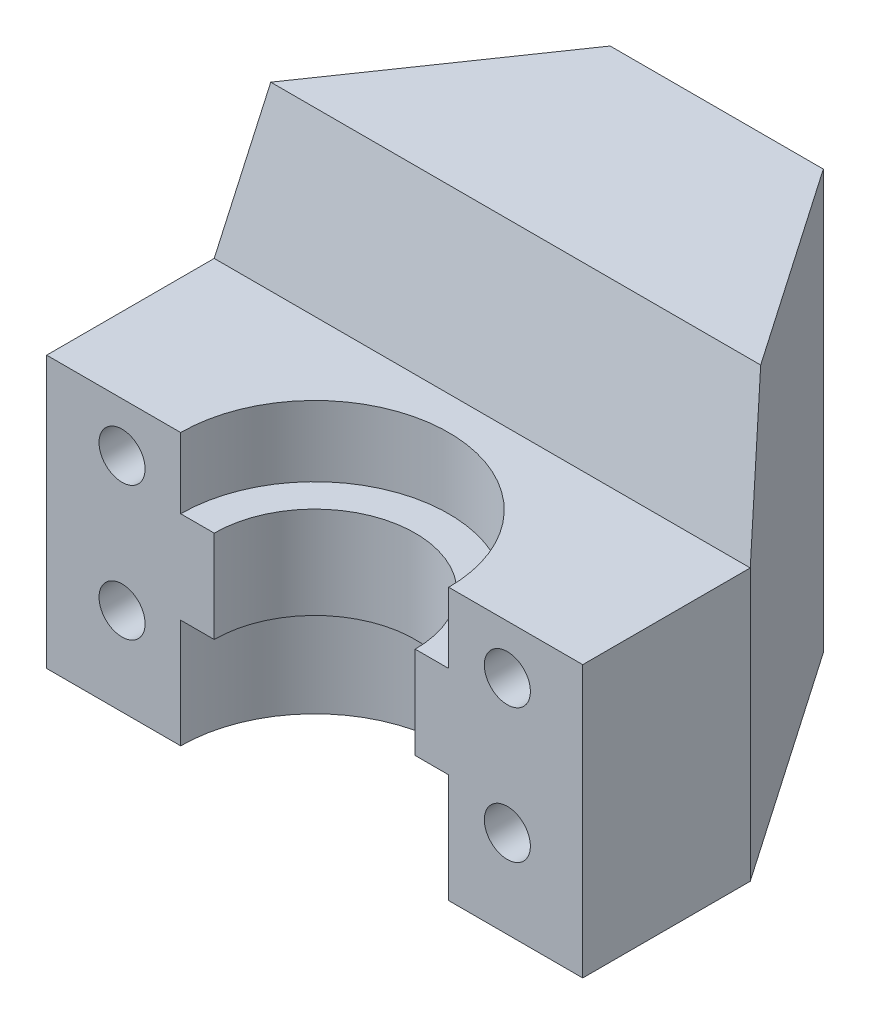
ISO-10303-21;
HEADER;
FILE_DESCRIPTION(('STEP AP214'),'2;1');
FILE_NAME('part.step','',(''),(''),'','','');
FILE_SCHEMA(('AUTOMOTIVE_DESIGN { 1 0 10303 214 1 1 1 1 }'));
ENDSEC;
DATA;
#1=APPLICATION_CONTEXT('core data for automotive mechanical design processes');
#2=APPLICATION_PROTOCOL_DEFINITION('international standard','automotive_design',2000,#1);
#3=PRODUCT_CONTEXT('',#1,'mechanical');
#4=PRODUCT('Part','Part','',(#3));
#5=PRODUCT_RELATED_PRODUCT_CATEGORY('part','',(#4));
#6=PRODUCT_DEFINITION_FORMATION('','',#4);
#7=PRODUCT_DEFINITION_CONTEXT('part definition',#1,'design');
#8=PRODUCT_DEFINITION('design','',#6,#7);
#9=PRODUCT_DEFINITION_SHAPE('','',#8);
#10=(LENGTH_UNIT() NAMED_UNIT(*) SI_UNIT(.MILLI.,.METRE.));
#11=(NAMED_UNIT(*) PLANE_ANGLE_UNIT() SI_UNIT($,.RADIAN.));
#12=(NAMED_UNIT(*) SI_UNIT($,.STERADIAN.) SOLID_ANGLE_UNIT());
#13=UNCERTAINTY_MEASURE_WITH_UNIT(LENGTH_MEASURE(1.E-05),#10,'distance_accuracy_value','');
#14=(GEOMETRIC_REPRESENTATION_CONTEXT(3) GLOBAL_UNCERTAINTY_ASSIGNED_CONTEXT((#13)) GLOBAL_UNIT_ASSIGNED_CONTEXT((#10,
#11,#12)) REPRESENTATION_CONTEXT('',''));
#15=CARTESIAN_POINT('',(0.,0.,0.));
#16=DIRECTION('',(0.,0.,1.));
#17=DIRECTION('',(1.,0.,0.));
#18=AXIS2_PLACEMENT_3D('',#15,#16,#17);
#19=CARTESIAN_POINT('',(-16.,16.2,12.));
#20=DIRECTION('',(0.,0.,-1.));
#21=DIRECTION('',(-1.,0.,0.));
#22=AXIS2_PLACEMENT_3D('',#19,#20,#21);
#23=PLANE('',#22);
#24=CARTESIAN_POINT('',(11.5,13.25,12.));
#25=DIRECTION('',(0.,0.,1.));
#26=DIRECTION('',(1.,0.,0.));
#27=AXIS2_PLACEMENT_3D('',#24,#25,#26);
#28=CIRCLE('',#27,1.375);
#29=CARTESIAN_POINT('',(12.875,13.25,12.));
#30=VERTEX_POINT('',#29);
#31=EDGE_CURVE('E161',#30,#30,#28,.T.);
#32=ORIENTED_EDGE('',*,*,#31,.F.);
#33=EDGE_LOOP('',(#32));
#34=FACE_BOUND('',#33,.T.);
#35=CARTESIAN_POINT('',(11.5,5.25,12.));
#36=DIRECTION('',(0.,0.,1.));
#37=DIRECTION('',(1.,0.,0.));
#38=AXIS2_PLACEMENT_3D('',#35,#36,#37);
#39=CIRCLE('',#38,1.375);
#40=CARTESIAN_POINT('',(12.875,5.25,12.));
#41=VERTEX_POINT('',#40);
#42=EDGE_CURVE('E178',#41,#41,#39,.T.);
#43=ORIENTED_EDGE('',*,*,#42,.F.);
#44=EDGE_LOOP('',(#43));
#45=FACE_BOUND('',#44,.T.);
#46=DIRECTION('',(1.,0.,0.));
#47=VECTOR('',#46,1.);
#48=CARTESIAN_POINT('',(-16.,16.2,12.));
#49=LINE('',#48,#47);
#50=CARTESIAN_POINT('',(8.,16.2,12.));
#51=VERTEX_POINT('',#50);
#52=CARTESIAN_POINT('',(16.,16.2,12.));
#53=VERTEX_POINT('',#52);
#54=EDGE_CURVE('E239',#51,#53,#49,.T.);
#55=ORIENTED_EDGE('',*,*,#54,.F.);
#56=DIRECTION('',(0.,-1.,0.));
#57=VECTOR('',#56,1.);
#58=CARTESIAN_POINT('',(8.,0.,12.));
#59=LINE('',#58,#57);
#60=CARTESIAN_POINT('',(8.,12.,12.));
#61=VERTEX_POINT('',#60);
#62=EDGE_CURVE('E62',#51,#61,#59,.T.);
#63=ORIENTED_EDGE('',*,*,#62,.T.);
#64=DIRECTION('',(-1.,0.,0.));
#65=VECTOR('',#64,1.);
#66=CARTESIAN_POINT('',(-16.,12.,12.));
#67=LINE('',#66,#65);
#68=CARTESIAN_POINT('',(6.,12.,12.));
#69=VERTEX_POINT('',#68);
#70=EDGE_CURVE('E11',#61,#69,#67,.T.);
#71=ORIENTED_EDGE('',*,*,#70,.T.);
#72=DIRECTION('',(0.,-1.,0.));
#73=VECTOR('',#72,1.);
#74=CARTESIAN_POINT('',(6.,0.,12.));
#75=LINE('',#74,#73);
#76=CARTESIAN_POINT('',(6.,6.5,12.));
#77=VERTEX_POINT('',#76);
#78=EDGE_CURVE('E41',#69,#77,#75,.T.);
#79=ORIENTED_EDGE('',*,*,#78,.T.);
#80=DIRECTION('',(1.,0.,0.));
#81=VECTOR('',#80,1.);
#82=CARTESIAN_POINT('',(-16.,6.5,12.));
#83=LINE('',#82,#81);
#84=CARTESIAN_POINT('',(8.,6.5,12.));
#85=VERTEX_POINT('',#84);
#86=EDGE_CURVE('E282',#77,#85,#83,.T.);
#87=ORIENTED_EDGE('',*,*,#86,.T.);
#88=DIRECTION('',(0.,-1.,0.));
#89=VECTOR('',#88,1.);
#90=CARTESIAN_POINT('',(8.,0.,12.));
#91=LINE('',#90,#89);
#92=CARTESIAN_POINT('',(8.,0.,12.));
#93=VERTEX_POINT('',#92);
#94=EDGE_CURVE('E285',#85,#93,#91,.T.);
#95=ORIENTED_EDGE('',*,*,#94,.T.);
#96=DIRECTION('',(1.,0.,0.));
#97=VECTOR('',#96,1.);
#98=CARTESIAN_POINT('',(-16.,0.,12.));
#99=LINE('',#98,#97);
#100=CARTESIAN_POINT('',(16.,0.,12.));
#101=VERTEX_POINT('',#100);
#102=EDGE_CURVE('E235',#93,#101,#99,.T.);
#103=ORIENTED_EDGE('',*,*,#102,.T.);
#104=DIRECTION('',(0.,-1.,0.));
#105=VECTOR('',#104,1.);
#106=CARTESIAN_POINT('',(16.,16.2,12.));
#107=LINE('',#106,#105);
#108=EDGE_CURVE('E247',#53,#101,#107,.T.);
#109=ORIENTED_EDGE('',*,*,#108,.F.);
#110=EDGE_LOOP('',(#55,#63,#71,#79,#87,#95,#103,#109));
#111=FACE_BOUND('',#110,.T.);
#112=ADVANCED_FACE('F37',(#34,#45,#111),#23,.F.);
#113=CARTESIAN_POINT('',(16.,0.,0.));
#114=DIRECTION('',(0.,1.,0.));
#115=DIRECTION('',(0.,0.,1.));
#116=AXIS2_PLACEMENT_3D('',#113,#114,#115);
#117=PLANE('',#116);
#118=DIRECTION('',(0.,0.,-1.));
#119=VECTOR('',#118,1.);
#120=CARTESIAN_POINT('',(-16.,0.,0.));
#121=LINE('',#120,#119);
#122=CARTESIAN_POINT('',(-16.,0.,12.));
#123=VERTEX_POINT('',#122);
#124=CARTESIAN_POINT('',(-16.,0.,2.));
#125=VERTEX_POINT('',#124);
#126=EDGE_CURVE('E258',#123,#125,#121,.T.);
#127=ORIENTED_EDGE('',*,*,#126,.T.);
#128=DIRECTION('',(-0.567028119188884,0.,0.823698435138198));
#129=VECTOR('',#128,1.);
#130=CARTESIAN_POINT('',(-9.92154544387538,0.,-6.82992101538207));
#131=LINE('',#130,#129);
#132=CARTESIAN_POINT('',(-6.3625,0.,-12.));
#133=VERTEX_POINT('',#132);
#134=EDGE_CURVE('E193',#133,#125,#131,.T.);
#135=ORIENTED_EDGE('',*,*,#134,.F.);
#136=DIRECTION('',(-1.,0.,0.));
#137=VECTOR('',#136,1.);
#138=CARTESIAN_POINT('',(16.,0.,-12.));
#139=LINE('',#138,#137);
#140=CARTESIAN_POINT('',(6.3625,0.,-12.));
#141=VERTEX_POINT('',#140);
#142=EDGE_CURVE('E270',#141,#133,#139,.T.);
#143=ORIENTED_EDGE('',*,*,#142,.F.);
#144=DIRECTION('',(-0.567028119188885,0.,-0.823698435138198));
#145=VECTOR('',#144,1.);
#146=CARTESIAN_POINT('',(9.92154544387538,0.,-6.82992101538207));
#147=LINE('',#146,#145);
#148=CARTESIAN_POINT('',(16.,0.,2.));
#149=VERTEX_POINT('',#148);
#150=EDGE_CURVE('E203',#149,#141,#147,.T.);
#151=ORIENTED_EDGE('',*,*,#150,.F.);
#152=DIRECTION('',(0.,0.,-1.));
#153=VECTOR('',#152,1.);
#154=CARTESIAN_POINT('',(16.,0.,0.));
#155=LINE('',#154,#153);
#156=EDGE_CURVE('E259',#101,#149,#155,.T.);
#157=ORIENTED_EDGE('',*,*,#156,.F.);
#158=ORIENTED_EDGE('',*,*,#102,.F.);
#159=CARTESIAN_POINT('',(0.,0.,12.));
#160=DIRECTION('',(0.,-1.,0.));
#161=DIRECTION('',(0.,0.,-1.));
#162=AXIS2_PLACEMENT_3D('',#159,#160,#161);
#163=CIRCLE('',#162,8.);
#164=CARTESIAN_POINT('',(-8.,0.,12.));
#165=VERTEX_POINT('',#164);
#166=EDGE_CURVE('E206',#165,#93,#163,.T.);
#167=ORIENTED_EDGE('',*,*,#166,.F.);
#168=EDGE_CURVE('E240',#123,#165,#99,.T.);
#169=ORIENTED_EDGE('',*,*,#168,.F.);
#170=EDGE_LOOP('',(#127,#135,#143,#151,#157,#158,#167,#169));
#171=FACE_BOUND('',#170,.T.);
#172=ADVANCED_FACE('F39',(#171),#117,.F.);
#173=CARTESIAN_POINT('',(16.,0.,-12.));
#174=DIRECTION('',(0.,0.,1.));
#175=DIRECTION('',(1.,0.,0.));
#176=AXIS2_PLACEMENT_3D('',#173,#174,#175);
#177=PLANE('',#176);
#178=CARTESIAN_POINT('',(0.,20.,-12.));
#179=DIRECTION('',(0.,0.,-1.));
#180=DIRECTION('',(-1.,0.,0.));
#181=AXIS2_PLACEMENT_3D('',#178,#179,#180);
#182=CIRCLE('',#181,2.09999999999999);
#183=CARTESIAN_POINT('',(-2.09999999999999,20.,-12.));
#184=VERTEX_POINT('',#183);
#185=EDGE_CURVE('E223',#184,#184,#182,.T.);
#186=ORIENTED_EDGE('',*,*,#185,.F.);
#187=EDGE_LOOP('',(#186));
#188=FACE_BOUND('',#187,.T.);
#189=CARTESIAN_POINT('',(0.,5.,-12.));
#190=DIRECTION('',(0.,0.,-1.));
#191=DIRECTION('',(-1.,0.,0.));
#192=AXIS2_PLACEMENT_3D('',#189,#190,#191);
#193=CIRCLE('',#192,2.09999999999999);
#194=CARTESIAN_POINT('',(-2.09999999999999,5.,-12.));
#195=VERTEX_POINT('',#194);
#196=EDGE_CURVE('E229',#195,#195,#193,.T.);
#197=ORIENTED_EDGE('',*,*,#196,.F.);
#198=EDGE_LOOP('',(#197));
#199=FACE_BOUND('',#198,.T.);
#200=ORIENTED_EDGE('',*,*,#142,.T.);
#201=DIRECTION('',(0.,1.,0.));
#202=VECTOR('',#201,1.);
#203=CARTESIAN_POINT('',(-6.3625,-0.001000000000001,-12.));
#204=LINE('',#203,#202);
#205=CARTESIAN_POINT('',(-6.3625,25.,-12.));
#206=VERTEX_POINT('',#205);
#207=EDGE_CURVE('E190',#133,#206,#204,.T.);
#208=ORIENTED_EDGE('',*,*,#207,.T.);
#209=DIRECTION('',(-1.,0.,0.));
#210=VECTOR('',#209,1.);
#211=CARTESIAN_POINT('',(16.,25.,-12.));
#212=LINE('',#211,#210);
#213=CARTESIAN_POINT('',(6.3625,25.,-12.));
#214=VERTEX_POINT('',#213);
#215=EDGE_CURVE('E267',#214,#206,#212,.T.);
#216=ORIENTED_EDGE('',*,*,#215,.F.);
#217=DIRECTION('',(0.,1.,0.));
#218=VECTOR('',#217,1.);
#219=CARTESIAN_POINT('',(6.3625,-0.001000000000001,-12.));
#220=LINE('',#219,#218);
#221=EDGE_CURVE('E199',#141,#214,#220,.T.);
#222=ORIENTED_EDGE('',*,*,#221,.F.);
#223=EDGE_LOOP('',(#200,#208,#216,#222));
#224=FACE_BOUND('',#223,.T.);
#225=ADVANCED_FACE('F333',(#188,#199,#224),#177,.F.);
#226=CARTESIAN_POINT('',(16.,25.,0.));
#227=DIRECTION('',(0.,1.,0.));
#228=DIRECTION('',(0.,0.,1.));
#229=AXIS2_PLACEMENT_3D('',#226,#227,#228);
#230=PLANE('',#229);
#231=DIRECTION('',(0.567028119188884,0.,-0.823698435138198));
#232=VECTOR('',#231,1.);
#233=CARTESIAN_POINT('',(-9.92154544387538,25.,-6.82992101538207));
#234=LINE('',#233,#232);
#235=CARTESIAN_POINT('',(-14.6232142857143,25.,0.));
#236=VERTEX_POINT('',#235);
#237=EDGE_CURVE('E187',#236,#206,#234,.T.);
#238=ORIENTED_EDGE('',*,*,#237,.F.);
#239=DIRECTION('',(-1.,0.,0.));
#240=VECTOR('',#239,1.);
#241=CARTESIAN_POINT('',(16.,25.,0.));
#242=LINE('',#241,#240);
#243=CARTESIAN_POINT('',(14.6232142857143,25.,0.));
#244=VERTEX_POINT('',#243);
#245=EDGE_CURVE('E262',#244,#236,#242,.T.);
#246=ORIENTED_EDGE('',*,*,#245,.F.);
#247=DIRECTION('',(0.567028119188885,0.,0.823698435138198));
#248=VECTOR('',#247,1.);
#249=CARTESIAN_POINT('',(9.92154544387538,25.,-6.82992101538207));
#250=LINE('',#249,#248);
#251=EDGE_CURVE('E54',#214,#244,#250,.T.);
#252=ORIENTED_EDGE('',*,*,#251,.F.);
#253=ORIENTED_EDGE('',*,*,#215,.T.);
#254=EDGE_LOOP('',(#238,#246,#252,#253));
#255=FACE_BOUND('',#254,.T.);
#256=ADVANCED_FACE('F329',(#255),#230,.T.);
#257=CARTESIAN_POINT('',(16.,0.,0.));
#258=DIRECTION('',(1.,0.,0.));
#259=DIRECTION('',(0.,0.,-1.));
#260=AXIS2_PLACEMENT_3D('',#257,#258,#259);
#261=PLANE('',#260);
#262=DIRECTION('',(0.,1.,0.));
#263=VECTOR('',#262,1.);
#264=CARTESIAN_POINT('',(16.,-0.001000000000001,2.));
#265=LINE('',#264,#263);
#266=CARTESIAN_POINT('',(16.,16.2,2.));
#267=VERTEX_POINT('',#266);
#268=EDGE_CURVE('E200',#149,#267,#265,.T.);
#269=ORIENTED_EDGE('',*,*,#268,.T.);
#270=DIRECTION('',(0.,0.,-1.));
#271=VECTOR('',#270,1.);
#272=CARTESIAN_POINT('',(16.,16.2,12.));
#273=LINE('',#272,#271);
#274=EDGE_CURVE('E244',#53,#267,#273,.T.);
#275=ORIENTED_EDGE('',*,*,#274,.F.);
#276=ORIENTED_EDGE('',*,*,#108,.T.);
#277=ORIENTED_EDGE('',*,*,#156,.T.);
#278=EDGE_LOOP('',(#269,#275,#276,#277));
#279=FACE_BOUND('',#278,.T.);
#280=ADVANCED_FACE('F316',(#279),#261,.T.);
#281=CARTESIAN_POINT('',(-16.,0.,0.));
#282=DIRECTION('',(1.,0.,0.));
#283=DIRECTION('',(0.,0.,-1.));
#284=AXIS2_PLACEMENT_3D('',#281,#282,#283);
#285=PLANE('',#284);
#286=DIRECTION('',(0.,0.,1.));
#287=VECTOR('',#286,1.);
#288=CARTESIAN_POINT('',(-16.,16.2,12.));
#289=LINE('',#288,#287);
#290=CARTESIAN_POINT('',(-16.,16.2,2.));
#291=VERTEX_POINT('',#290);
#292=CARTESIAN_POINT('',(-16.,16.2,12.));
#293=VERTEX_POINT('',#292);
#294=EDGE_CURVE('E236',#291,#293,#289,.T.);
#295=ORIENTED_EDGE('',*,*,#294,.F.);
#296=DIRECTION('',(0.,1.,0.));
#297=VECTOR('',#296,1.);
#298=CARTESIAN_POINT('',(-16.,-0.001000000000001,2.00000000000001));
#299=LINE('',#298,#297);
#300=EDGE_CURVE('E189',#125,#291,#299,.T.);
#301=ORIENTED_EDGE('',*,*,#300,.F.);
#302=ORIENTED_EDGE('',*,*,#126,.F.);
#303=DIRECTION('',(0.,-1.,0.));
#304=VECTOR('',#303,1.);
#305=CARTESIAN_POINT('',(-16.,16.2,12.));
#306=LINE('',#305,#304);
#307=EDGE_CURVE('E252',#293,#123,#306,.T.);
#308=ORIENTED_EDGE('',*,*,#307,.F.);
#309=EDGE_LOOP('',(#295,#301,#302,#308));
#310=FACE_BOUND('',#309,.T.);
#311=ADVANCED_FACE('F364',(#310),#285,.F.);
#312=CARTESIAN_POINT('',(-41.0798724079689,25.,0.));
#313=DIRECTION('',(0.,0.221621103588968,0.97513285579146));
#314=DIRECTION('',(0.,-0.97513285579146,0.221621103588968));
#315=AXIS2_PLACEMENT_3D('',#312,#313,#314);
#316=PLANE('',#315);
#317=DIRECTION('',(-0.150817322697507,-0.963978944556828,0.219086123762915));
#318=VECTOR('',#317,1.);
#319=CARTESIAN_POINT('',(-17.9253601038493,3.89367757228364,4.79689146084463));
#320=LINE('',#319,#318);
#321=EDGE_CURVE('E184',#236,#291,#320,.T.);
#322=ORIENTED_EDGE('',*,*,#321,.T.);
#323=DIRECTION('',(1.,0.,0.));
#324=VECTOR('',#323,1.);
#325=CARTESIAN_POINT('',(-41.0798724079689,16.2,2.00000000000001));
#326=LINE('',#325,#324);
#327=EDGE_CURVE('E255',#291,#267,#326,.T.);
#328=ORIENTED_EDGE('',*,*,#327,.T.);
#329=DIRECTION('',(-0.150817322697507,0.963978944556828,-0.219086123762915));
#330=VECTOR('',#329,1.);
#331=CARTESIAN_POINT('',(17.9253601038493,3.89367757228364,4.79689146084463));
#332=LINE('',#331,#330);
#333=EDGE_CURVE('E196',#267,#244,#332,.T.);
#334=ORIENTED_EDGE('',*,*,#333,.T.);
#335=ORIENTED_EDGE('',*,*,#245,.T.);
#336=EDGE_LOOP('',(#322,#328,#334,#335));
#337=FACE_BOUND('',#336,.T.);
#338=ADVANCED_FACE('F322',(#337),#316,.T.);
#339=CARTESIAN_POINT('',(-11.5,13.25,12.));
#340=DIRECTION('',(0.,0.,1.));
#341=DIRECTION('',(1.,0.,0.));
#342=AXIS2_PLACEMENT_3D('',#339,#340,#341);
#343=CIRCLE('',#342,1.375);
#344=CARTESIAN_POINT('',(-10.125,13.25,12.));
#345=VERTEX_POINT('',#344);
#346=EDGE_CURVE('E162',#345,#345,#343,.T.);
#347=ORIENTED_EDGE('',*,*,#346,.F.);
#348=EDGE_LOOP('',(#347));
#349=FACE_BOUND('',#348,.T.);
#350=CARTESIAN_POINT('',(-11.5,5.25,12.));
#351=DIRECTION('',(0.,0.,1.));
#352=DIRECTION('',(1.,0.,0.));
#353=AXIS2_PLACEMENT_3D('',#350,#351,#352);
#354=CIRCLE('',#353,1.375);
#355=CARTESIAN_POINT('',(-10.125,5.25,12.));
#356=VERTEX_POINT('',#355);
#357=EDGE_CURVE('E172',#356,#356,#354,.T.);
#358=ORIENTED_EDGE('',*,*,#357,.F.);
#359=EDGE_LOOP('',(#358));
#360=FACE_BOUND('',#359,.T.);
#361=CARTESIAN_POINT('',(-6.,12.,12.));
#362=VERTEX_POINT('',#361);
#363=CARTESIAN_POINT('',(-8.,12.,12.));
#364=VERTEX_POINT('',#363);
#365=EDGE_CURVE('E47',#362,#364,#67,.T.);
#366=ORIENTED_EDGE('',*,*,#365,.T.);
#367=DIRECTION('',(0.,-1.,0.));
#368=VECTOR('',#367,1.);
#369=CARTESIAN_POINT('',(-8.,0.,12.));
#370=LINE('',#369,#368);
#371=CARTESIAN_POINT('',(-8.,16.2,12.));
#372=VERTEX_POINT('',#371);
#373=EDGE_CURVE('E219',#364,#372,#370,.F.);
#374=ORIENTED_EDGE('',*,*,#373,.T.);
#375=EDGE_CURVE('E241',#293,#372,#49,.T.);
#376=ORIENTED_EDGE('',*,*,#375,.F.);
#377=ORIENTED_EDGE('',*,*,#307,.T.);
#378=ORIENTED_EDGE('',*,*,#168,.T.);
#379=DIRECTION('',(0.,-1.,0.));
#380=VECTOR('',#379,1.);
#381=CARTESIAN_POINT('',(-8.,0.,12.));
#382=LINE('',#381,#380);
#383=CARTESIAN_POINT('',(-8.,6.5,12.));
#384=VERTEX_POINT('',#383);
#385=EDGE_CURVE('E275',#165,#384,#382,.F.);
#386=ORIENTED_EDGE('',*,*,#385,.T.);
#387=CARTESIAN_POINT('',(-6.,6.5,12.));
#388=VERTEX_POINT('',#387);
#389=EDGE_CURVE('E278',#384,#388,#83,.T.);
#390=ORIENTED_EDGE('',*,*,#389,.T.);
#391=DIRECTION('',(0.,-1.,0.));
#392=VECTOR('',#391,1.);
#393=CARTESIAN_POINT('',(-6.,0.,12.));
#394=LINE('',#393,#392);
#395=EDGE_CURVE('E281',#388,#362,#394,.F.);
#396=ORIENTED_EDGE('',*,*,#395,.T.);
#397=EDGE_LOOP('',(#366,#374,#376,#377,#378,#386,#390,#396));
#398=FACE_BOUND('',#397,.T.);
#399=ADVANCED_FACE('F300',(#349,#360,#398),#23,.F.);
#400=CARTESIAN_POINT('',(0.,16.2,0.));
#401=DIRECTION('',(0.,-1.,0.));
#402=DIRECTION('',(0.,0.,-1.));
#403=AXIS2_PLACEMENT_3D('',#400,#401,#402);
#404=PLANE('',#403);
#405=ORIENTED_EDGE('',*,*,#375,.T.);
#406=CARTESIAN_POINT('',(0.,16.2,12.));
#407=DIRECTION('',(0.,-1.,0.));
#408=DIRECTION('',(0.,0.,-1.));
#409=AXIS2_PLACEMENT_3D('',#406,#407,#408);
#410=CIRCLE('',#409,8.);
#411=EDGE_CURVE('E273',#372,#51,#410,.T.);
#412=ORIENTED_EDGE('',*,*,#411,.T.);
#413=ORIENTED_EDGE('',*,*,#54,.T.);
#414=ORIENTED_EDGE('',*,*,#274,.T.);
#415=ORIENTED_EDGE('',*,*,#327,.F.);
#416=ORIENTED_EDGE('',*,*,#294,.T.);
#417=EDGE_LOOP('',(#405,#412,#413,#414,#415,#416));
#418=FACE_BOUND('',#417,.T.);
#419=ADVANCED_FACE('F319',(#418),#404,.F.);
#420=CARTESIAN_POINT('',(0.,5.,-3.));
#421=DIRECTION('',(0.,0.,-1.));
#422=DIRECTION('',(-1.,0.,0.));
#423=AXIS2_PLACEMENT_3D('',#420,#421,#422);
#424=CONICAL_SURFACE('',#423,2.1,1.02974425867665);
#425=CARTESIAN_POINT('',(0.,5.,-1.73819270004212));
#426=VERTEX_POINT('',#425);
#427=VERTEX_LOOP('',#426);
#428=FACE_BOUND('',#427,.T.);
#429=CARTESIAN_POINT('',(0.,5.,-3.));
#430=DIRECTION('',(0.,0.,-1.));
#431=DIRECTION('',(-1.,0.,0.));
#432=AXIS2_PLACEMENT_3D('',#429,#430,#431);
#433=CIRCLE('',#432,2.1);
#434=CARTESIAN_POINT('',(-2.1,5.,-3.));
#435=VERTEX_POINT('',#434);
#436=EDGE_CURVE('E232',#435,#435,#433,.T.);
#437=ORIENTED_EDGE('',*,*,#436,.T.);
#438=EDGE_LOOP('',(#437));
#439=FACE_BOUND('',#438,.T.);
#440=ADVANCED_FACE('F363',(#428,#439),#424,.F.);
#441=CARTESIAN_POINT('',(0.,5.,-12.));
#442=DIRECTION('',(0.,0.,-1.));
#443=DIRECTION('',(-1.,0.,0.));
#444=AXIS2_PLACEMENT_3D('',#441,#442,#443);
#445=CYLINDRICAL_SURFACE('',#444,2.09999999999999);
#446=ORIENTED_EDGE('',*,*,#436,.F.);
#447=EDGE_LOOP('',(#446));
#448=FACE_BOUND('',#447,.T.);
#449=ORIENTED_EDGE('',*,*,#196,.T.);
#450=EDGE_LOOP('',(#449));
#451=FACE_BOUND('',#450,.T.);
#452=ADVANCED_FACE('F480',(#448,#451),#445,.F.);
#453=CARTESIAN_POINT('',(0.,20.,-3.));
#454=DIRECTION('',(0.,0.,-1.));
#455=DIRECTION('',(-1.,0.,0.));
#456=AXIS2_PLACEMENT_3D('',#453,#454,#455);
#457=CONICAL_SURFACE('',#456,2.1,1.02974425867665);
#458=CARTESIAN_POINT('',(0.,20.,-1.73819270004212));
#459=VERTEX_POINT('',#458);
#460=VERTEX_LOOP('',#459);
#461=FACE_BOUND('',#460,.T.);
#462=CARTESIAN_POINT('',(0.,20.,-3.));
#463=DIRECTION('',(0.,0.,-1.));
#464=DIRECTION('',(-1.,0.,0.));
#465=AXIS2_PLACEMENT_3D('',#462,#463,#464);
#466=CIRCLE('',#465,2.1);
#467=CARTESIAN_POINT('',(-2.1,20.,-3.));
#468=VERTEX_POINT('',#467);
#469=EDGE_CURVE('E226',#468,#468,#466,.T.);
#470=ORIENTED_EDGE('',*,*,#469,.T.);
#471=EDGE_LOOP('',(#470));
#472=FACE_BOUND('',#471,.T.);
#473=ADVANCED_FACE('F471',(#461,#472),#457,.F.);
#474=CARTESIAN_POINT('',(0.,20.,-12.));
#475=DIRECTION('',(0.,0.,-1.));
#476=DIRECTION('',(-1.,0.,0.));
#477=AXIS2_PLACEMENT_3D('',#474,#475,#476);
#478=CYLINDRICAL_SURFACE('',#477,2.09999999999999);
#479=ORIENTED_EDGE('',*,*,#469,.F.);
#480=EDGE_LOOP('',(#479));
#481=FACE_BOUND('',#480,.T.);
#482=ORIENTED_EDGE('',*,*,#185,.T.);
#483=EDGE_LOOP('',(#482));
#484=FACE_BOUND('',#483,.T.);
#485=ADVANCED_FACE('F466',(#481,#484),#478,.F.);
#486=CARTESIAN_POINT('',(0.,12.,4.));
#487=DIRECTION('',(0.,-1.,0.));
#488=DIRECTION('',(0.,0.,-1.));
#489=AXIS2_PLACEMENT_3D('',#486,#487,#488);
#490=PLANE('',#489);
#491=CARTESIAN_POINT('',(0.,12.,12.));
#492=DIRECTION('',(0.,-1.,0.));
#493=DIRECTION('',(0.,0.,-1.));
#494=AXIS2_PLACEMENT_3D('',#491,#492,#493);
#495=CIRCLE('',#494,8.);
#496=EDGE_CURVE('E217',#364,#61,#495,.T.);
#497=ORIENTED_EDGE('',*,*,#496,.F.);
#498=ORIENTED_EDGE('',*,*,#365,.F.);
#499=CARTESIAN_POINT('',(0.,12.,12.));
#500=DIRECTION('',(0.,-1.,0.));
#501=DIRECTION('',(0.,0.,-1.));
#502=AXIS2_PLACEMENT_3D('',#499,#500,#501);
#503=CIRCLE('',#502,6.);
#504=EDGE_CURVE('E214',#362,#69,#503,.T.);
#505=ORIENTED_EDGE('',*,*,#504,.T.);
#506=ORIENTED_EDGE('',*,*,#70,.F.);
#507=EDGE_LOOP('',(#497,#498,#505,#506));
#508=FACE_BOUND('',#507,.T.);
#509=ADVANCED_FACE('F298',(#508),#490,.F.);
#510=CARTESIAN_POINT('',(0.,0.,12.));
#511=DIRECTION('',(0.,-1.,0.));
#512=DIRECTION('',(0.,0.,-1.));
#513=AXIS2_PLACEMENT_3D('',#510,#511,#512);
#514=CYLINDRICAL_SURFACE('',#513,6.);
#515=ORIENTED_EDGE('',*,*,#504,.F.);
#516=ORIENTED_EDGE('',*,*,#395,.F.);
#517=CARTESIAN_POINT('',(0.,6.5,12.));
#518=DIRECTION('',(0.,-1.,0.));
#519=DIRECTION('',(0.,0.,-1.));
#520=AXIS2_PLACEMENT_3D('',#517,#518,#519);
#521=CIRCLE('',#520,6.);
#522=EDGE_CURVE('E211',#388,#77,#521,.T.);
#523=ORIENTED_EDGE('',*,*,#522,.T.);
#524=ORIENTED_EDGE('',*,*,#78,.F.);
#525=EDGE_LOOP('',(#515,#516,#523,#524));
#526=FACE_BOUND('',#525,.T.);
#527=ADVANCED_FACE('F294',(#526),#514,.F.);
#528=CARTESIAN_POINT('',(0.,6.5,6.));
#529=DIRECTION('',(0.,1.,0.));
#530=DIRECTION('',(0.,0.,1.));
#531=AXIS2_PLACEMENT_3D('',#528,#529,#530);
#532=PLANE('',#531);
#533=CARTESIAN_POINT('',(0.,6.5,12.));
#534=DIRECTION('',(0.,-1.,0.));
#535=DIRECTION('',(0.,0.,-1.));
#536=AXIS2_PLACEMENT_3D('',#533,#534,#535);
#537=CIRCLE('',#536,8.);
#538=EDGE_CURVE('E208',#384,#85,#537,.T.);
#539=ORIENTED_EDGE('',*,*,#538,.T.);
#540=ORIENTED_EDGE('',*,*,#86,.F.);
#541=ORIENTED_EDGE('',*,*,#522,.F.);
#542=ORIENTED_EDGE('',*,*,#389,.F.);
#543=EDGE_LOOP('',(#539,#540,#541,#542));
#544=FACE_BOUND('',#543,.T.);
#545=ADVANCED_FACE('F302',(#544),#532,.F.);
#546=CARTESIAN_POINT('',(0.,0.,12.));
#547=DIRECTION('',(0.,-1.,0.));
#548=DIRECTION('',(0.,0.,-1.));
#549=AXIS2_PLACEMENT_3D('',#546,#547,#548);
#550=CYLINDRICAL_SURFACE('',#549,8.);
#551=ORIENTED_EDGE('',*,*,#538,.F.);
#552=ORIENTED_EDGE('',*,*,#385,.F.);
#553=ORIENTED_EDGE('',*,*,#166,.T.);
#554=ORIENTED_EDGE('',*,*,#94,.F.);
#555=EDGE_LOOP('',(#551,#552,#553,#554));
#556=FACE_BOUND('',#555,.T.);
#557=ADVANCED_FACE('F305',(#556),#550,.F.);
#558=CARTESIAN_POINT('',(0.,0.,12.));
#559=DIRECTION('',(0.,-1.,0.));
#560=DIRECTION('',(0.,0.,-1.));
#561=AXIS2_PLACEMENT_3D('',#558,#559,#560);
#562=CYLINDRICAL_SURFACE('',#561,8.);
#563=ORIENTED_EDGE('',*,*,#411,.F.);
#564=ORIENTED_EDGE('',*,*,#373,.F.);
#565=ORIENTED_EDGE('',*,*,#496,.T.);
#566=ORIENTED_EDGE('',*,*,#62,.F.);
#567=EDGE_LOOP('',(#563,#564,#565,#566));
#568=FACE_BOUND('',#567,.T.);
#569=ADVANCED_FACE('F337',(#568),#562,.F.);
#570=CARTESIAN_POINT('',(9.92154544387538,-0.001000000000001,-6.82992101538207));
#571=DIRECTION('',(-0.823698435138198,0.,0.567028119188885));
#572=DIRECTION('',(0.567028119188885,0.,0.823698435138198));
#573=AXIS2_PLACEMENT_3D('',#570,#571,#572);
#574=PLANE('',#573);
#575=ORIENTED_EDGE('',*,*,#150,.T.);
#576=ORIENTED_EDGE('',*,*,#221,.T.);
#577=ORIENTED_EDGE('',*,*,#251,.T.);
#578=ORIENTED_EDGE('',*,*,#333,.F.);
#579=ORIENTED_EDGE('',*,*,#268,.F.);
#580=EDGE_LOOP('',(#575,#576,#577,#578,#579));
#581=FACE_BOUND('',#580,.T.);
#582=ADVANCED_FACE('F335',(#581),#574,.F.);
#583=CARTESIAN_POINT('',(-9.92154544387538,-0.001000000000001,-6.82992101538207));
#584=DIRECTION('',(0.823698435138198,0.,0.567028119188884));
#585=DIRECTION('',(0.567028119188884,0.,-0.823698435138198));
#586=AXIS2_PLACEMENT_3D('',#583,#584,#585);
#587=PLANE('',#586);
#588=ORIENTED_EDGE('',*,*,#134,.T.);
#589=ORIENTED_EDGE('',*,*,#300,.T.);
#590=ORIENTED_EDGE('',*,*,#321,.F.);
#591=ORIENTED_EDGE('',*,*,#237,.T.);
#592=ORIENTED_EDGE('',*,*,#207,.F.);
#593=EDGE_LOOP('',(#588,#589,#590,#591,#592));
#594=FACE_BOUND('',#593,.T.);
#595=ADVANCED_FACE('F326',(#594),#587,.F.);
#596=CARTESIAN_POINT('',(11.5,5.25,0.));
#597=DIRECTION('',(0.,0.,1.));
#598=DIRECTION('',(1.,0.,0.));
#599=AXIS2_PLACEMENT_3D('',#596,#597,#598);
#600=CONICAL_SURFACE('',#599,1.375,1.02974425867665);
#601=CARTESIAN_POINT('',(11.5,5.25,-0.826183351162895));
#602=VERTEX_POINT('',#601);
#603=VERTEX_LOOP('',#602);
#604=FACE_BOUND('',#603,.T.);
#605=CARTESIAN_POINT('',(11.5,5.25,0.));
#606=DIRECTION('',(0.,0.,1.));
#607=DIRECTION('',(1.,0.,0.));
#608=AXIS2_PLACEMENT_3D('',#605,#606,#607);
#609=CIRCLE('',#608,1.375);
#610=CARTESIAN_POINT('',(12.875,5.25,0.));
#611=VERTEX_POINT('',#610);
#612=EDGE_CURVE('E181',#611,#611,#609,.T.);
#613=ORIENTED_EDGE('',*,*,#612,.T.);
#614=EDGE_LOOP('',(#613));
#615=FACE_BOUND('',#614,.T.);
#616=ADVANCED_FACE('F343',(#604,#615),#600,.F.);
#617=CARTESIAN_POINT('',(11.5,5.25,12.));
#618=DIRECTION('',(0.,0.,1.));
#619=DIRECTION('',(1.,0.,0.));
#620=AXIS2_PLACEMENT_3D('',#617,#618,#619);
#621=CYLINDRICAL_SURFACE('',#620,1.375);
#622=ORIENTED_EDGE('',*,*,#612,.F.);
#623=EDGE_LOOP('',(#622));
#624=FACE_BOUND('',#623,.T.);
#625=ORIENTED_EDGE('',*,*,#42,.T.);
#626=EDGE_LOOP('',(#625));
#627=FACE_BOUND('',#626,.T.);
#628=ADVANCED_FACE('F381',(#624,#627),#621,.F.);
#629=CARTESIAN_POINT('',(-11.5,5.25,0.));
#630=DIRECTION('',(0.,0.,1.));
#631=DIRECTION('',(1.,0.,0.));
#632=AXIS2_PLACEMENT_3D('',#629,#630,#631);
#633=CONICAL_SURFACE('',#632,1.375,1.02974425867665);
#634=CARTESIAN_POINT('',(-11.5,5.25,-0.826183351162895));
#635=VERTEX_POINT('',#634);
#636=VERTEX_LOOP('',#635);
#637=FACE_BOUND('',#636,.T.);
#638=CARTESIAN_POINT('',(-11.5,5.25,0.));
#639=DIRECTION('',(0.,0.,1.));
#640=DIRECTION('',(1.,0.,0.));
#641=AXIS2_PLACEMENT_3D('',#638,#639,#640);
#642=CIRCLE('',#641,1.375);
#643=CARTESIAN_POINT('',(-10.125,5.25,0.));
#644=VERTEX_POINT('',#643);
#645=EDGE_CURVE('E175',#644,#644,#642,.T.);
#646=ORIENTED_EDGE('',*,*,#645,.T.);
#647=EDGE_LOOP('',(#646));
#648=FACE_BOUND('',#647,.T.);
#649=ADVANCED_FACE('F372',(#637,#648),#633,.F.);
#650=CARTESIAN_POINT('',(-11.5,5.25,12.));
#651=DIRECTION('',(0.,0.,1.));
#652=DIRECTION('',(1.,0.,0.));
#653=AXIS2_PLACEMENT_3D('',#650,#651,#652);
#654=CYLINDRICAL_SURFACE('',#653,1.375);
#655=ORIENTED_EDGE('',*,*,#645,.F.);
#656=EDGE_LOOP('',(#655));
#657=FACE_BOUND('',#656,.T.);
#658=ORIENTED_EDGE('',*,*,#357,.T.);
#659=EDGE_LOOP('',(#658));
#660=FACE_BOUND('',#659,.T.);
#661=ADVANCED_FACE('F369',(#657,#660),#654,.F.);
#662=CARTESIAN_POINT('',(11.5,13.25,0.));
#663=DIRECTION('',(0.,0.,1.));
#664=DIRECTION('',(1.,0.,0.));
#665=AXIS2_PLACEMENT_3D('',#662,#663,#664);
#666=CONICAL_SURFACE('',#665,1.375,1.02974425867665);
#667=CARTESIAN_POINT('',(11.5,13.25,-0.826183351162895));
#668=VERTEX_POINT('',#667);
#669=VERTEX_LOOP('',#668);
#670=FACE_BOUND('',#669,.T.);
#671=CARTESIAN_POINT('',(11.5,13.25,0.));
#672=DIRECTION('',(0.,0.,1.));
#673=DIRECTION('',(1.,0.,0.));
#674=AXIS2_PLACEMENT_3D('',#671,#672,#673);
#675=CIRCLE('',#674,1.375);
#676=CARTESIAN_POINT('',(12.875,13.25,0.));
#677=VERTEX_POINT('',#676);
#678=EDGE_CURVE('E165',#677,#677,#675,.T.);
#679=ORIENTED_EDGE('',*,*,#678,.T.);
#680=EDGE_LOOP('',(#679));
#681=FACE_BOUND('',#680,.T.);
#682=ADVANCED_FACE('F371',(#670,#681),#666,.F.);
#683=CARTESIAN_POINT('',(11.5,13.25,12.));
#684=DIRECTION('',(0.,0.,1.));
#685=DIRECTION('',(1.,0.,0.));
#686=AXIS2_PLACEMENT_3D('',#683,#684,#685);
#687=CYLINDRICAL_SURFACE('',#686,1.375);
#688=ORIENTED_EDGE('',*,*,#678,.F.);
#689=EDGE_LOOP('',(#688));
#690=FACE_BOUND('',#689,.T.);
#691=ORIENTED_EDGE('',*,*,#31,.T.);
#692=EDGE_LOOP('',(#691));
#693=FACE_BOUND('',#692,.T.);
#694=ADVANCED_FACE('F155',(#690,#693),#687,.F.);
#695=CARTESIAN_POINT('',(-11.5,13.25,0.));
#696=DIRECTION('',(0.,0.,1.));
#697=DIRECTION('',(1.,0.,0.));
#698=AXIS2_PLACEMENT_3D('',#695,#696,#697);
#699=CONICAL_SURFACE('',#698,1.375,1.02974425867665);
#700=CARTESIAN_POINT('',(-11.5,13.25,-0.826183351162895));
#701=VERTEX_POINT('',#700);
#702=VERTEX_LOOP('',#701);
#703=FACE_BOUND('',#702,.T.);
#704=CARTESIAN_POINT('',(-11.5,13.25,0.));
#705=DIRECTION('',(0.,0.,1.));
#706=DIRECTION('',(1.,0.,0.));
#707=AXIS2_PLACEMENT_3D('',#704,#705,#706);
#708=CIRCLE('',#707,1.375);
#709=CARTESIAN_POINT('',(-10.125,13.25,0.));
#710=VERTEX_POINT('',#709);
#711=EDGE_CURVE('E159',#710,#710,#708,.T.);
#712=ORIENTED_EDGE('',*,*,#711,.T.);
#713=EDGE_LOOP('',(#712));
#714=FACE_BOUND('',#713,.T.);
#715=ADVANCED_FACE('F151',(#703,#714),#699,.F.);
#716=CARTESIAN_POINT('',(-11.5,13.25,12.));
#717=DIRECTION('',(0.,0.,1.));
#718=DIRECTION('',(1.,0.,0.));
#719=AXIS2_PLACEMENT_3D('',#716,#717,#718);
#720=CYLINDRICAL_SURFACE('',#719,1.375);
#721=ORIENTED_EDGE('',*,*,#711,.F.);
#722=EDGE_LOOP('',(#721));
#723=FACE_BOUND('',#722,.T.);
#724=ORIENTED_EDGE('',*,*,#346,.T.);
#725=EDGE_LOOP('',(#724));
#726=FACE_BOUND('',#725,.T.);
#727=ADVANCED_FACE('F154',(#723,#726),#720,.F.);
#728=CLOSED_SHELL('',(#112,#172,#225,#256,#280,#311,#338,#399,#419,#440,#452,#473,#485,#509,
#527,#545,#557,#569,#582,#595,#616,#628,#649,#661,#682,#694,#715,#727));
#729=MANIFOLD_SOLID_BREP('B2',#728);
#730=ADVANCED_BREP_SHAPE_REPRESENTATION('',(#18,#729),#14);
#731=SHAPE_DEFINITION_REPRESENTATION(#9,#730);
ENDSEC;
END-ISO-10303-21;
